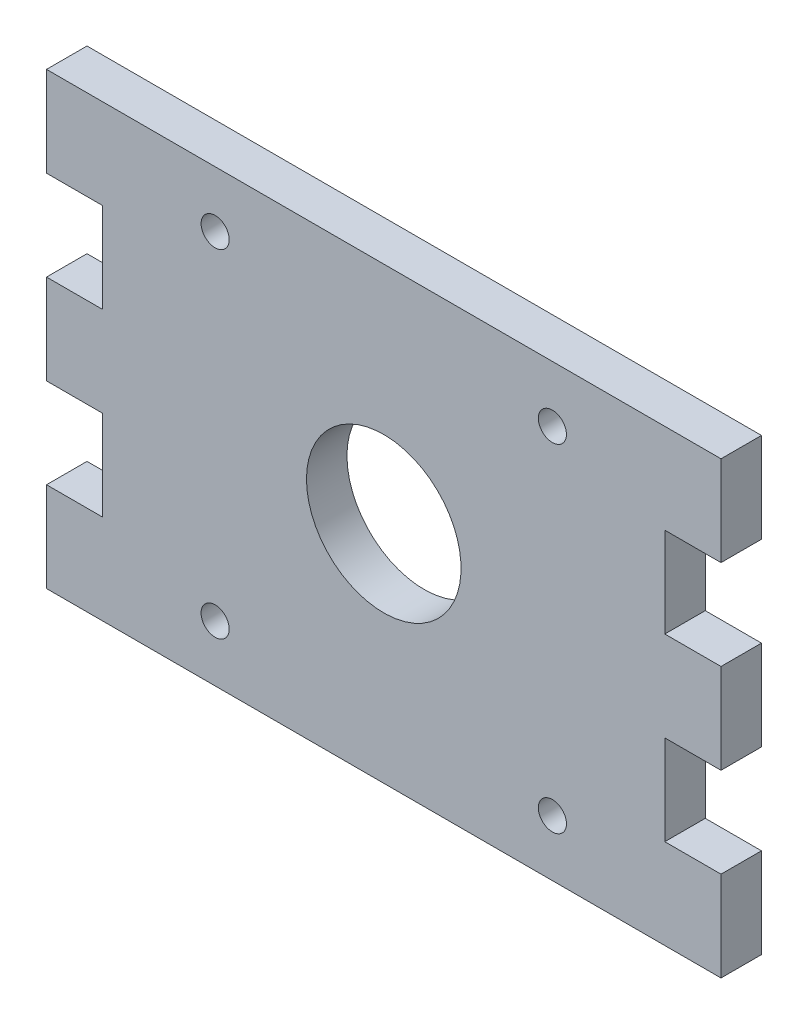
ISO-10303-21;
HEADER;
FILE_DESCRIPTION(('STEP AP214'),'2;1');
FILE_NAME('part.step','',(''),(''),'','','');
FILE_SCHEMA(('AUTOMOTIVE_DESIGN { 1 0 10303 214 1 1 1 1 }'));
ENDSEC;
DATA;
#1=APPLICATION_CONTEXT('core data for automotive mechanical design processes');
#2=APPLICATION_PROTOCOL_DEFINITION('international standard','automotive_design',2000,#1);
#3=PRODUCT_CONTEXT('',#1,'mechanical');
#4=PRODUCT('Part','Part','',(#3));
#5=PRODUCT_RELATED_PRODUCT_CATEGORY('part','',(#4));
#6=PRODUCT_DEFINITION_FORMATION('','',#4);
#7=PRODUCT_DEFINITION_CONTEXT('part definition',#1,'design');
#8=PRODUCT_DEFINITION('design','',#6,#7);
#9=PRODUCT_DEFINITION_SHAPE('','',#8);
#10=(LENGTH_UNIT() NAMED_UNIT(*) SI_UNIT(.MILLI.,.METRE.));
#11=(NAMED_UNIT(*) PLANE_ANGLE_UNIT() SI_UNIT($,.RADIAN.));
#12=(NAMED_UNIT(*) SI_UNIT($,.STERADIAN.) SOLID_ANGLE_UNIT());
#13=UNCERTAINTY_MEASURE_WITH_UNIT(LENGTH_MEASURE(1.E-05),#10,'distance_accuracy_value','');
#14=(GEOMETRIC_REPRESENTATION_CONTEXT(3) GLOBAL_UNCERTAINTY_ASSIGNED_CONTEXT((#13)) GLOBAL_UNIT_ASSIGNED_CONTEXT((#10,
#11,#12)) REPRESENTATION_CONTEXT('',''));
#15=CARTESIAN_POINT('',(0.,0.,0.));
#16=DIRECTION('',(0.,0.,1.));
#17=DIRECTION('',(1.,0.,0.));
#18=AXIS2_PLACEMENT_3D('',#15,#16,#17);
#19=CARTESIAN_POINT('',(0.,50.8,4.572));
#20=DIRECTION('',(0.,0.,-1.));
#21=DIRECTION('',(-1.,0.,0.));
#22=AXIS2_PLACEMENT_3D('',#19,#20,#21);
#23=PLANE('',#22);
#24=CARTESIAN_POINT('',(57.150000000022,6.34999999999933,4.572));
#25=DIRECTION('',(0.,0.,-1.));
#26=DIRECTION('',(-1.,0.,0.));
#27=AXIS2_PLACEMENT_3D('',#24,#25,#26);
#28=CIRCLE('',#27,1.58750000002028);
#29=CARTESIAN_POINT('',(55.5625000000017,6.34999999999933,4.572));
#30=VERTEX_POINT('',#29);
#31=EDGE_CURVE('E241',#30,#30,#28,.T.);
#32=ORIENTED_EDGE('',*,*,#31,.T.);
#33=EDGE_LOOP('',(#32));
#34=FACE_BOUND('',#33,.T.);
#35=CARTESIAN_POINT('',(57.1500000000189,44.4500000000022,4.572));
#36=DIRECTION('',(0.,0.,-1.));
#37=DIRECTION('',(-1.,0.,0.));
#38=AXIS2_PLACEMENT_3D('',#35,#36,#37);
#39=CIRCLE('',#38,1.58750000001656);
#40=CARTESIAN_POINT('',(55.5625000000024,44.4500000000022,4.572));
#41=VERTEX_POINT('',#40);
#42=EDGE_CURVE('E247',#41,#41,#39,.T.);
#43=ORIENTED_EDGE('',*,*,#42,.T.);
#44=EDGE_LOOP('',(#43));
#45=FACE_BOUND('',#44,.T.);
#46=CARTESIAN_POINT('',(19.0500000000181,6.35000000000216,4.572));
#47=DIRECTION('',(0.,0.,-1.));
#48=DIRECTION('',(-1.,0.,0.));
#49=AXIS2_PLACEMENT_3D('',#46,#47,#48);
#50=CIRCLE('',#49,1.5875000000158);
#51=CARTESIAN_POINT('',(17.4625000000023,6.35000000000216,4.572));
#52=VERTEX_POINT('',#51);
#53=EDGE_CURVE('E253',#52,#52,#50,.T.);
#54=ORIENTED_EDGE('',*,*,#53,.T.);
#55=EDGE_LOOP('',(#54));
#56=FACE_BOUND('',#55,.T.);
#57=CARTESIAN_POINT('',(19.0500000000189,44.4500000000022,4.572));
#58=DIRECTION('',(0.,0.,-1.));
#59=DIRECTION('',(-1.,0.,0.));
#60=AXIS2_PLACEMENT_3D('',#57,#58,#59);
#61=CIRCLE('',#60,1.58750000001656);
#62=CARTESIAN_POINT('',(17.4625000000024,44.4500000000022,4.572));
#63=VERTEX_POINT('',#62);
#64=EDGE_CURVE('E259',#63,#63,#61,.T.);
#65=ORIENTED_EDGE('',*,*,#64,.T.);
#66=EDGE_LOOP('',(#65));
#67=FACE_BOUND('',#66,.T.);
#68=CARTESIAN_POINT('',(38.1,25.4,4.572));
#69=DIRECTION('',(0.,0.,-1.));
#70=DIRECTION('',(-1.,0.,0.));
#71=AXIS2_PLACEMENT_3D('',#68,#69,#70);
#72=CIRCLE('',#71,8.73125);
#73=CARTESIAN_POINT('',(29.36875,25.4,4.572));
#74=VERTEX_POINT('',#73);
#75=EDGE_CURVE('E265',#74,#74,#72,.T.);
#76=ORIENTED_EDGE('',*,*,#75,.T.);
#77=EDGE_LOOP('',(#76));
#78=FACE_BOUND('',#77,.T.);
#79=DIRECTION('',(1.,0.,0.));
#80=VECTOR('',#79,1.);
#81=CARTESIAN_POINT('',(69.85,10.16,4.57200000000001));
#82=LINE('',#81,#80);
#83=CARTESIAN_POINT('',(69.85,10.16,4.57200000000001));
#84=VERTEX_POINT('',#83);
#85=CARTESIAN_POINT('',(76.2,10.16,4.57200000000001));
#86=VERTEX_POINT('',#85);
#87=EDGE_CURVE('E195',#84,#86,#82,.T.);
#88=ORIENTED_EDGE('',*,*,#87,.F.);
#89=DIRECTION('',(0.,-1.,0.));
#90=VECTOR('',#89,1.);
#91=CARTESIAN_POINT('',(69.8500000000001,50.8,4.57200000000001));
#92=LINE('',#91,#90);
#93=CARTESIAN_POINT('',(69.85,20.32,4.57200000000001));
#94=VERTEX_POINT('',#93);
#95=EDGE_CURVE('E190',#94,#84,#92,.T.);
#96=ORIENTED_EDGE('',*,*,#95,.F.);
#97=DIRECTION('',(1.,0.,0.));
#98=VECTOR('',#97,1.);
#99=CARTESIAN_POINT('',(69.85,20.32,4.57200000000001));
#100=LINE('',#99,#98);
#101=CARTESIAN_POINT('',(76.2,20.32,4.57200000000001));
#102=VERTEX_POINT('',#101);
#103=EDGE_CURVE('E370',#94,#102,#100,.T.);
#104=ORIENTED_EDGE('',*,*,#103,.T.);
#105=DIRECTION('',(0.,1.,0.));
#106=VECTOR('',#105,1.);
#107=CARTESIAN_POINT('',(76.2,0.,4.572));
#108=LINE('',#107,#106);
#109=CARTESIAN_POINT('',(76.2,30.48,4.57200000000001));
#110=VERTEX_POINT('',#109);
#111=EDGE_CURVE('E283',#102,#110,#108,.T.);
#112=ORIENTED_EDGE('',*,*,#111,.T.);
#113=DIRECTION('',(1.,0.,0.));
#114=VECTOR('',#113,1.);
#115=CARTESIAN_POINT('',(69.85,30.48,4.57200000000001));
#116=LINE('',#115,#114);
#117=CARTESIAN_POINT('',(69.85,30.48,4.57200000000001));
#118=VERTEX_POINT('',#117);
#119=EDGE_CURVE('E188',#118,#110,#116,.T.);
#120=ORIENTED_EDGE('',*,*,#119,.F.);
#121=CARTESIAN_POINT('',(69.8500000000001,40.64,4.57200000000001));
#122=VERTEX_POINT('',#121);
#123=EDGE_CURVE('E171',#122,#118,#92,.T.);
#124=ORIENTED_EDGE('',*,*,#123,.F.);
#125=DIRECTION('',(1.,0.,0.));
#126=VECTOR('',#125,1.);
#127=CARTESIAN_POINT('',(69.8500000000001,40.64,4.57200000000001));
#128=LINE('',#127,#126);
#129=CARTESIAN_POINT('',(76.2,40.64,4.57200000000001));
#130=VERTEX_POINT('',#129);
#131=EDGE_CURVE('E175',#122,#130,#128,.T.);
#132=ORIENTED_EDGE('',*,*,#131,.T.);
#133=CARTESIAN_POINT('',(76.2,50.8,4.572));
#134=VERTEX_POINT('',#133);
#135=EDGE_CURVE('E278',#130,#134,#108,.T.);
#136=ORIENTED_EDGE('',*,*,#135,.T.);
#137=DIRECTION('',(-1.,0.,0.));
#138=VECTOR('',#137,1.);
#139=CARTESIAN_POINT('',(0.,50.8,4.572));
#140=LINE('',#139,#138);
#141=CARTESIAN_POINT('',(0.,50.8,4.572));
#142=VERTEX_POINT('',#141);
#143=EDGE_CURVE('E282',#134,#142,#140,.T.);
#144=ORIENTED_EDGE('',*,*,#143,.T.);
#145=DIRECTION('',(0.,-1.,0.));
#146=VECTOR('',#145,1.);
#147=CARTESIAN_POINT('',(0.,0.,4.572));
#148=LINE('',#147,#146);
#149=CARTESIAN_POINT('',(0.,40.64,4.57199999999998));
#150=VERTEX_POINT('',#149);
#151=EDGE_CURVE('E271',#142,#150,#148,.T.);
#152=ORIENTED_EDGE('',*,*,#151,.T.);
#153=DIRECTION('',(1.,0.,0.));
#154=VECTOR('',#153,1.);
#155=CARTESIAN_POINT('',(0.,40.64,4.57199999999998));
#156=LINE('',#155,#154);
#157=CARTESIAN_POINT('',(6.35,40.64,4.57199999999998));
#158=VERTEX_POINT('',#157);
#159=EDGE_CURVE('E200',#150,#158,#156,.T.);
#160=ORIENTED_EDGE('',*,*,#159,.T.);
#161=DIRECTION('',(0.,-1.,0.));
#162=VECTOR('',#161,1.);
#163=CARTESIAN_POINT('',(6.35,50.8,4.57199999999998));
#164=LINE('',#163,#162);
#165=CARTESIAN_POINT('',(6.34999999999999,30.48,4.57199999999998));
#166=VERTEX_POINT('',#165);
#167=EDGE_CURVE('E237',#158,#166,#164,.T.);
#168=ORIENTED_EDGE('',*,*,#167,.T.);
#169=DIRECTION('',(1.,0.,0.));
#170=VECTOR('',#169,1.);
#171=CARTESIAN_POINT('',(0.,30.48,4.57199999999998));
#172=LINE('',#171,#170);
#173=CARTESIAN_POINT('',(0.,30.48,4.57199999999998));
#174=VERTEX_POINT('',#173);
#175=EDGE_CURVE('E216',#174,#166,#172,.T.);
#176=ORIENTED_EDGE('',*,*,#175,.F.);
#177=CARTESIAN_POINT('',(0.,20.32,4.57199999999998));
#178=VERTEX_POINT('',#177);
#179=EDGE_CURVE('E275',#174,#178,#148,.T.);
#180=ORIENTED_EDGE('',*,*,#179,.T.);
#181=DIRECTION('',(1.,0.,0.));
#182=VECTOR('',#181,1.);
#183=CARTESIAN_POINT('',(0.,20.32,4.57199999999998));
#184=LINE('',#183,#182);
#185=CARTESIAN_POINT('',(6.34999999999999,20.32,4.57199999999998));
#186=VERTEX_POINT('',#185);
#187=EDGE_CURVE('E212',#178,#186,#184,.T.);
#188=ORIENTED_EDGE('',*,*,#187,.T.);
#189=CARTESIAN_POINT('',(6.34999999999999,10.16,4.57199999999998));
#190=VERTEX_POINT('',#189);
#191=EDGE_CURVE('E234',#186,#190,#164,.T.);
#192=ORIENTED_EDGE('',*,*,#191,.T.);
#193=DIRECTION('',(1.,0.,0.));
#194=VECTOR('',#193,1.);
#195=CARTESIAN_POINT('',(0.,10.16,4.57199999999998));
#196=LINE('',#195,#194);
#197=CARTESIAN_POINT('',(0.,10.16,4.57199999999998));
#198=VERTEX_POINT('',#197);
#199=EDGE_CURVE('E231',#198,#190,#196,.T.);
#200=ORIENTED_EDGE('',*,*,#199,.F.);
#201=CARTESIAN_POINT('',(0.,0.,4.572));
#202=VERTEX_POINT('',#201);
#203=EDGE_CURVE('E276',#198,#202,#148,.T.);
#204=ORIENTED_EDGE('',*,*,#203,.T.);
#205=DIRECTION('',(1.,0.,0.));
#206=VECTOR('',#205,1.);
#207=CARTESIAN_POINT('',(0.,0.,4.572));
#208=LINE('',#207,#206);
#209=CARTESIAN_POINT('',(76.2,0.,4.572));
#210=VERTEX_POINT('',#209);
#211=EDGE_CURVE('E274',#202,#210,#208,.T.);
#212=ORIENTED_EDGE('',*,*,#211,.T.);
#213=EDGE_CURVE('E279',#210,#86,#108,.T.);
#214=ORIENTED_EDGE('',*,*,#213,.T.);
#215=EDGE_LOOP('',(#88,#96,#104,#112,#120,#124,#132,#136,#144,#152,#160,#168,#176,#180,#188,
#192,#200,#204,#212,#214));
#216=FACE_BOUND('',#215,.T.);
#217=ADVANCED_FACE('F34',(#34,#45,#56,#67,#78,#216),#23,.F.);
#218=CARTESIAN_POINT('',(76.2,0.,4.572));
#219=DIRECTION('',(-1.,0.,0.));
#220=DIRECTION('',(0.,-1.,0.));
#221=AXIS2_PLACEMENT_3D('',#218,#219,#220);
#222=PLANE('',#221);
#223=DIRECTION('',(0.,0.,1.));
#224=VECTOR('',#223,1.);
#225=CARTESIAN_POINT('',(76.2,10.16,4.57200000000001));
#226=LINE('',#225,#224);
#227=CARTESIAN_POINT('',(76.2,10.16,0.));
#228=VERTEX_POINT('',#227);
#229=EDGE_CURVE('E355',#228,#86,#226,.T.);
#230=ORIENTED_EDGE('',*,*,#229,.T.);
#231=ORIENTED_EDGE('',*,*,#213,.F.);
#232=DIRECTION('',(0.,0.,-1.));
#233=VECTOR('',#232,1.);
#234=CARTESIAN_POINT('',(76.2,0.,4.572));
#235=LINE('',#234,#233);
#236=CARTESIAN_POINT('',(76.2,0.,0.));
#237=VERTEX_POINT('',#236);
#238=EDGE_CURVE('E304',#210,#237,#235,.T.);
#239=ORIENTED_EDGE('',*,*,#238,.T.);
#240=DIRECTION('',(0.,1.,0.));
#241=VECTOR('',#240,1.);
#242=CARTESIAN_POINT('',(76.2,0.,0.));
#243=LINE('',#242,#241);
#244=EDGE_CURVE('E293',#237,#228,#243,.T.);
#245=ORIENTED_EDGE('',*,*,#244,.T.);
#246=EDGE_LOOP('',(#230,#231,#239,#245));
#247=FACE_BOUND('',#246,.T.);
#248=ADVANCED_FACE('F354',(#247),#222,.F.);
#249=DIRECTION('',(0.,0.,1.));
#250=VECTOR('',#249,1.);
#251=CARTESIAN_POINT('',(76.2,30.48,4.57200000000001));
#252=LINE('',#251,#250);
#253=CARTESIAN_POINT('',(76.2,30.48,0.));
#254=VERTEX_POINT('',#253);
#255=EDGE_CURVE('E381',#254,#110,#252,.T.);
#256=ORIENTED_EDGE('',*,*,#255,.T.);
#257=ORIENTED_EDGE('',*,*,#111,.F.);
#258=DIRECTION('',(0.,0.,-1.));
#259=VECTOR('',#258,1.);
#260=CARTESIAN_POINT('',(76.2,20.32,4.57200000000001));
#261=LINE('',#260,#259);
#262=CARTESIAN_POINT('',(76.2,20.32,0.));
#263=VERTEX_POINT('',#262);
#264=EDGE_CURVE('E379',#102,#263,#261,.T.);
#265=ORIENTED_EDGE('',*,*,#264,.T.);
#266=EDGE_CURVE('E297',#263,#254,#243,.T.);
#267=ORIENTED_EDGE('',*,*,#266,.T.);
#268=EDGE_LOOP('',(#256,#257,#265,#267));
#269=FACE_BOUND('',#268,.T.);
#270=ADVANCED_FACE('F377',(#269),#222,.F.);
#271=DIRECTION('',(0.,0.,-1.));
#272=VECTOR('',#271,1.);
#273=CARTESIAN_POINT('',(76.2,40.64,4.57200000000001));
#274=LINE('',#273,#272);
#275=CARTESIAN_POINT('',(76.2,40.64,0.));
#276=VERTEX_POINT('',#275);
#277=EDGE_CURVE('E176',#130,#276,#274,.T.);
#278=ORIENTED_EDGE('',*,*,#277,.T.);
#279=CARTESIAN_POINT('',(76.2,50.8,0.));
#280=VERTEX_POINT('',#279);
#281=EDGE_CURVE('E292',#276,#280,#243,.T.);
#282=ORIENTED_EDGE('',*,*,#281,.T.);
#283=DIRECTION('',(0.,0.,-1.));
#284=VECTOR('',#283,1.);
#285=CARTESIAN_POINT('',(76.2,50.8,4.572));
#286=LINE('',#285,#284);
#287=EDGE_CURVE('E301',#134,#280,#286,.T.);
#288=ORIENTED_EDGE('',*,*,#287,.F.);
#289=ORIENTED_EDGE('',*,*,#135,.F.);
#290=EDGE_LOOP('',(#278,#282,#288,#289));
#291=FACE_BOUND('',#290,.T.);
#292=ADVANCED_FACE('F386',(#291),#222,.F.);
#293=CARTESIAN_POINT('',(0.,0.,4.572));
#294=DIRECTION('',(1.,0.,0.));
#295=DIRECTION('',(0.,1.,0.));
#296=AXIS2_PLACEMENT_3D('',#293,#294,#295);
#297=PLANE('',#296);
#298=DIRECTION('',(0.,0.,1.));
#299=VECTOR('',#298,1.);
#300=CARTESIAN_POINT('',(0.,10.16,4.57199999999998));
#301=LINE('',#300,#299);
#302=CARTESIAN_POINT('',(0.,10.16,0.));
#303=VERTEX_POINT('',#302);
#304=EDGE_CURVE('E227',#303,#198,#301,.T.);
#305=ORIENTED_EDGE('',*,*,#304,.F.);
#306=DIRECTION('',(0.,-1.,0.));
#307=VECTOR('',#306,1.);
#308=CARTESIAN_POINT('',(0.,0.,0.));
#309=LINE('',#308,#307);
#310=CARTESIAN_POINT('',(0.,0.,0.));
#311=VERTEX_POINT('',#310);
#312=EDGE_CURVE('E268',#303,#311,#309,.T.);
#313=ORIENTED_EDGE('',*,*,#312,.T.);
#314=DIRECTION('',(0.,0.,-1.));
#315=VECTOR('',#314,1.);
#316=CARTESIAN_POINT('',(0.,0.,4.572));
#317=LINE('',#316,#315);
#318=EDGE_CURVE('E307',#202,#311,#317,.T.);
#319=ORIENTED_EDGE('',*,*,#318,.F.);
#320=ORIENTED_EDGE('',*,*,#203,.F.);
#321=EDGE_LOOP('',(#305,#313,#319,#320));
#322=FACE_BOUND('',#321,.T.);
#323=ADVANCED_FACE('F36',(#322),#297,.F.);
#324=DIRECTION('',(0.,0.,1.));
#325=VECTOR('',#324,1.);
#326=CARTESIAN_POINT('',(0.,30.48,4.57199999999998));
#327=LINE('',#326,#325);
#328=CARTESIAN_POINT('',(0.,30.48,0.));
#329=VERTEX_POINT('',#328);
#330=EDGE_CURVE('E209',#329,#174,#327,.T.);
#331=ORIENTED_EDGE('',*,*,#330,.F.);
#332=CARTESIAN_POINT('',(0.,20.32,0.));
#333=VERTEX_POINT('',#332);
#334=EDGE_CURVE('E290',#329,#333,#309,.T.);
#335=ORIENTED_EDGE('',*,*,#334,.T.);
#336=DIRECTION('',(0.,0.,-1.));
#337=VECTOR('',#336,1.);
#338=CARTESIAN_POINT('',(0.,20.32,4.57199999999998));
#339=LINE('',#338,#337);
#340=EDGE_CURVE('E207',#178,#333,#339,.T.);
#341=ORIENTED_EDGE('',*,*,#340,.F.);
#342=ORIENTED_EDGE('',*,*,#179,.F.);
#343=EDGE_LOOP('',(#331,#335,#341,#342));
#344=FACE_BOUND('',#343,.T.);
#345=ADVANCED_FACE('F340',(#344),#297,.F.);
#346=DIRECTION('',(0.,0.,-1.));
#347=VECTOR('',#346,1.);
#348=CARTESIAN_POINT('',(0.,40.64,4.57199999999998));
#349=LINE('',#348,#347);
#350=CARTESIAN_POINT('',(0.,40.64,0.));
#351=VERTEX_POINT('',#350);
#352=EDGE_CURVE('E193',#150,#351,#349,.T.);
#353=ORIENTED_EDGE('',*,*,#352,.F.);
#354=ORIENTED_EDGE('',*,*,#151,.F.);
#355=DIRECTION('',(0.,0.,-1.));
#356=VECTOR('',#355,1.);
#357=CARTESIAN_POINT('',(0.,50.8,4.572));
#358=LINE('',#357,#356);
#359=CARTESIAN_POINT('',(0.,50.8,0.));
#360=VERTEX_POINT('',#359);
#361=EDGE_CURVE('E285',#142,#360,#358,.T.);
#362=ORIENTED_EDGE('',*,*,#361,.T.);
#363=EDGE_CURVE('E286',#360,#351,#309,.T.);
#364=ORIENTED_EDGE('',*,*,#363,.T.);
#365=EDGE_LOOP('',(#353,#354,#362,#364));
#366=FACE_BOUND('',#365,.T.);
#367=ADVANCED_FACE('F395',(#366),#297,.F.);
#368=CARTESIAN_POINT('',(0.,0.,4.572));
#369=DIRECTION('',(0.,1.,0.));
#370=DIRECTION('',(0.,0.,1.));
#371=AXIS2_PLACEMENT_3D('',#368,#369,#370);
#372=PLANE('',#371);
#373=DIRECTION('',(1.,0.,0.));
#374=VECTOR('',#373,1.);
#375=CARTESIAN_POINT('',(0.,0.,0.));
#376=LINE('',#375,#374);
#377=EDGE_CURVE('E289',#311,#237,#376,.T.);
#378=ORIENTED_EDGE('',*,*,#377,.T.);
#379=ORIENTED_EDGE('',*,*,#238,.F.);
#380=ORIENTED_EDGE('',*,*,#211,.F.);
#381=ORIENTED_EDGE('',*,*,#318,.T.);
#382=EDGE_LOOP('',(#378,#379,#380,#381));
#383=FACE_BOUND('',#382,.T.);
#384=ADVANCED_FACE('F349',(#383),#372,.F.);
#385=CARTESIAN_POINT('',(0.,50.8,4.572));
#386=DIRECTION('',(0.,-1.,0.));
#387=DIRECTION('',(0.,0.,-1.));
#388=AXIS2_PLACEMENT_3D('',#385,#386,#387);
#389=PLANE('',#388);
#390=DIRECTION('',(-1.,0.,0.));
#391=VECTOR('',#390,1.);
#392=CARTESIAN_POINT('',(0.,50.8,0.));
#393=LINE('',#392,#391);
#394=EDGE_CURVE('E296',#280,#360,#393,.T.);
#395=ORIENTED_EDGE('',*,*,#394,.T.);
#396=ORIENTED_EDGE('',*,*,#361,.F.);
#397=ORIENTED_EDGE('',*,*,#143,.F.);
#398=ORIENTED_EDGE('',*,*,#287,.T.);
#399=EDGE_LOOP('',(#395,#396,#397,#398));
#400=FACE_BOUND('',#399,.T.);
#401=ADVANCED_FACE('F390',(#400),#389,.F.);
#402=CARTESIAN_POINT('',(0.,50.8,0.));
#403=DIRECTION('',(0.,0.,-1.));
#404=DIRECTION('',(-1.,0.,0.));
#405=AXIS2_PLACEMENT_3D('',#402,#403,#404);
#406=PLANE('',#405);
#407=DIRECTION('',(0.,1.,0.));
#408=VECTOR('',#407,1.);
#409=CARTESIAN_POINT('',(69.8500000000001,50.8,0.));
#410=LINE('',#409,#408);
#411=CARTESIAN_POINT('',(69.85,10.16,0.));
#412=VERTEX_POINT('',#411);
#413=CARTESIAN_POINT('',(69.85,20.32,0.));
#414=VERTEX_POINT('',#413);
#415=EDGE_CURVE('E42',#412,#414,#410,.T.);
#416=ORIENTED_EDGE('',*,*,#415,.F.);
#417=DIRECTION('',(1.,0.,0.));
#418=VECTOR('',#417,1.);
#419=CARTESIAN_POINT('',(69.85,10.16,0.));
#420=LINE('',#419,#418);
#421=EDGE_CURVE('E198',#412,#228,#420,.T.);
#422=ORIENTED_EDGE('',*,*,#421,.T.);
#423=ORIENTED_EDGE('',*,*,#244,.F.);
#424=ORIENTED_EDGE('',*,*,#377,.F.);
#425=ORIENTED_EDGE('',*,*,#312,.F.);
#426=DIRECTION('',(1.,0.,0.));
#427=VECTOR('',#426,1.);
#428=CARTESIAN_POINT('',(0.,10.16,0.));
#429=LINE('',#428,#427);
#430=CARTESIAN_POINT('',(6.34999999999999,10.16,0.));
#431=VERTEX_POINT('',#430);
#432=EDGE_CURVE('E229',#303,#431,#429,.T.);
#433=ORIENTED_EDGE('',*,*,#432,.T.);
#434=DIRECTION('',(0.,1.,0.));
#435=VECTOR('',#434,1.);
#436=CARTESIAN_POINT('',(6.35,50.8,0.));
#437=LINE('',#436,#435);
#438=CARTESIAN_POINT('',(6.34999999999999,20.32,0.));
#439=VERTEX_POINT('',#438);
#440=EDGE_CURVE('E309',#431,#439,#437,.T.);
#441=ORIENTED_EDGE('',*,*,#440,.T.);
#442=DIRECTION('',(1.,0.,0.));
#443=VECTOR('',#442,1.);
#444=CARTESIAN_POINT('',(0.,20.32,0.));
#445=LINE('',#444,#443);
#446=EDGE_CURVE('E223',#333,#439,#445,.T.);
#447=ORIENTED_EDGE('',*,*,#446,.F.);
#448=ORIENTED_EDGE('',*,*,#334,.F.);
#449=DIRECTION('',(1.,0.,0.));
#450=VECTOR('',#449,1.);
#451=CARTESIAN_POINT('',(0.,30.48,0.));
#452=LINE('',#451,#450);
#453=CARTESIAN_POINT('',(6.34999999999999,30.48,0.));
#454=VERTEX_POINT('',#453);
#455=EDGE_CURVE('E220',#329,#454,#452,.T.);
#456=ORIENTED_EDGE('',*,*,#455,.T.);
#457=CARTESIAN_POINT('',(6.35,40.64,0.));
#458=VERTEX_POINT('',#457);
#459=EDGE_CURVE('E310',#454,#458,#437,.T.);
#460=ORIENTED_EDGE('',*,*,#459,.T.);
#461=DIRECTION('',(1.,0.,0.));
#462=VECTOR('',#461,1.);
#463=CARTESIAN_POINT('',(0.,40.64,0.));
#464=LINE('',#463,#462);
#465=EDGE_CURVE('E202',#351,#458,#464,.T.);
#466=ORIENTED_EDGE('',*,*,#465,.F.);
#467=ORIENTED_EDGE('',*,*,#363,.F.);
#468=ORIENTED_EDGE('',*,*,#394,.F.);
#469=ORIENTED_EDGE('',*,*,#281,.F.);
#470=DIRECTION('',(1.,0.,0.));
#471=VECTOR('',#470,1.);
#472=CARTESIAN_POINT('',(69.8500000000001,40.64,0.));
#473=LINE('',#472,#471);
#474=CARTESIAN_POINT('',(69.8500000000001,40.64,0.));
#475=VERTEX_POINT('',#474);
#476=EDGE_CURVE('E183',#475,#276,#473,.T.);
#477=ORIENTED_EDGE('',*,*,#476,.F.);
#478=CARTESIAN_POINT('',(69.85,30.48,0.));
#479=VERTEX_POINT('',#478);
#480=EDGE_CURVE('E11',#479,#475,#410,.T.);
#481=ORIENTED_EDGE('',*,*,#480,.F.);
#482=DIRECTION('',(1.,0.,0.));
#483=VECTOR('',#482,1.);
#484=CARTESIAN_POINT('',(69.85,30.48,0.));
#485=LINE('',#484,#483);
#486=EDGE_CURVE('E362',#479,#254,#485,.T.);
#487=ORIENTED_EDGE('',*,*,#486,.T.);
#488=ORIENTED_EDGE('',*,*,#266,.F.);
#489=DIRECTION('',(1.,0.,0.));
#490=VECTOR('',#489,1.);
#491=CARTESIAN_POINT('',(69.85,20.32,0.));
#492=LINE('',#491,#490);
#493=EDGE_CURVE('E372',#414,#263,#492,.T.);
#494=ORIENTED_EDGE('',*,*,#493,.F.);
#495=EDGE_LOOP('',(#416,#422,#423,#424,#425,#433,#441,#447,#448,#456,#460,#466,#467,#468,#469,
#477,#481,#487,#488,#494));
#496=FACE_BOUND('',#495,.T.);
#497=CARTESIAN_POINT('',(57.150000000022,6.34999999999933,0.));
#498=DIRECTION('',(0.,0.,-1.));
#499=DIRECTION('',(-1.,0.,0.));
#500=AXIS2_PLACEMENT_3D('',#497,#498,#499);
#501=CIRCLE('',#500,1.58750000002028);
#502=CARTESIAN_POINT('',(55.5625000000017,6.34999999999933,0.));
#503=VERTEX_POINT('',#502);
#504=EDGE_CURVE('E240',#503,#503,#501,.T.);
#505=ORIENTED_EDGE('',*,*,#504,.F.);
#506=EDGE_LOOP('',(#505));
#507=FACE_BOUND('',#506,.T.);
#508=CARTESIAN_POINT('',(57.1500000000189,44.4500000000022,0.));
#509=DIRECTION('',(0.,0.,-1.));
#510=DIRECTION('',(-1.,0.,0.));
#511=AXIS2_PLACEMENT_3D('',#508,#509,#510);
#512=CIRCLE('',#511,1.58750000001656);
#513=CARTESIAN_POINT('',(55.5625000000024,44.4500000000022,0.));
#514=VERTEX_POINT('',#513);
#515=EDGE_CURVE('E244',#514,#514,#512,.T.);
#516=ORIENTED_EDGE('',*,*,#515,.F.);
#517=EDGE_LOOP('',(#516));
#518=FACE_BOUND('',#517,.T.);
#519=CARTESIAN_POINT('',(19.0500000000181,6.35000000000216,0.));
#520=DIRECTION('',(0.,0.,-1.));
#521=DIRECTION('',(-1.,0.,0.));
#522=AXIS2_PLACEMENT_3D('',#519,#520,#521);
#523=CIRCLE('',#522,1.5875000000158);
#524=CARTESIAN_POINT('',(17.4625000000023,6.35000000000216,0.));
#525=VERTEX_POINT('',#524);
#526=EDGE_CURVE('E250',#525,#525,#523,.T.);
#527=ORIENTED_EDGE('',*,*,#526,.F.);
#528=EDGE_LOOP('',(#527));
#529=FACE_BOUND('',#528,.T.);
#530=CARTESIAN_POINT('',(19.0500000000189,44.4500000000022,0.));
#531=DIRECTION('',(0.,0.,-1.));
#532=DIRECTION('',(-1.,0.,0.));
#533=AXIS2_PLACEMENT_3D('',#530,#531,#532);
#534=CIRCLE('',#533,1.58750000001656);
#535=CARTESIAN_POINT('',(17.4625000000024,44.4500000000022,0.));
#536=VERTEX_POINT('',#535);
#537=EDGE_CURVE('E256',#536,#536,#534,.T.);
#538=ORIENTED_EDGE('',*,*,#537,.F.);
#539=EDGE_LOOP('',(#538));
#540=FACE_BOUND('',#539,.T.);
#541=CARTESIAN_POINT('',(38.1,25.4,0.));
#542=DIRECTION('',(0.,0.,-1.));
#543=DIRECTION('',(-1.,0.,0.));
#544=AXIS2_PLACEMENT_3D('',#541,#542,#543);
#545=CIRCLE('',#544,8.73125);
#546=CARTESIAN_POINT('',(29.36875,25.4,0.));
#547=VERTEX_POINT('',#546);
#548=EDGE_CURVE('E262',#547,#547,#545,.T.);
#549=ORIENTED_EDGE('',*,*,#548,.F.);
#550=EDGE_LOOP('',(#549));
#551=FACE_BOUND('',#550,.T.);
#552=ADVANCED_FACE('F317',(#496,#507,#518,#529,#540,#551),#406,.T.);
#553=CARTESIAN_POINT('',(38.1,25.4,4.572));
#554=DIRECTION('',(0.,0.,-1.));
#555=DIRECTION('',(-1.,0.,0.));
#556=AXIS2_PLACEMENT_3D('',#553,#554,#555);
#557=CYLINDRICAL_SURFACE('',#556,8.73125);
#558=ORIENTED_EDGE('',*,*,#75,.F.);
#559=EDGE_LOOP('',(#558));
#560=FACE_BOUND('',#559,.T.);
#561=ORIENTED_EDGE('',*,*,#548,.T.);
#562=EDGE_LOOP('',(#561));
#563=FACE_BOUND('',#562,.T.);
#564=ADVANCED_FACE('F424',(#560,#563),#557,.F.);
#565=CARTESIAN_POINT('',(19.0500000000189,44.4500000000022,4.572));
#566=DIRECTION('',(0.,0.,-1.));
#567=DIRECTION('',(-1.,0.,0.));
#568=AXIS2_PLACEMENT_3D('',#565,#566,#567);
#569=CYLINDRICAL_SURFACE('',#568,1.58750000001656);
#570=ORIENTED_EDGE('',*,*,#64,.F.);
#571=EDGE_LOOP('',(#570));
#572=FACE_BOUND('',#571,.T.);
#573=ORIENTED_EDGE('',*,*,#537,.T.);
#574=EDGE_LOOP('',(#573));
#575=FACE_BOUND('',#574,.T.);
#576=ADVANCED_FACE('F484',(#572,#575),#569,.F.);
#577=CARTESIAN_POINT('',(19.0500000000181,6.35000000000216,4.572));
#578=DIRECTION('',(0.,0.,-1.));
#579=DIRECTION('',(-1.,0.,0.));
#580=AXIS2_PLACEMENT_3D('',#577,#578,#579);
#581=CYLINDRICAL_SURFACE('',#580,1.5875000000158);
#582=ORIENTED_EDGE('',*,*,#53,.F.);
#583=EDGE_LOOP('',(#582));
#584=FACE_BOUND('',#583,.T.);
#585=ORIENTED_EDGE('',*,*,#526,.T.);
#586=EDGE_LOOP('',(#585));
#587=FACE_BOUND('',#586,.T.);
#588=ADVANCED_FACE('F474',(#584,#587),#581,.F.);
#589=CARTESIAN_POINT('',(57.1500000000189,44.4500000000022,4.572));
#590=DIRECTION('',(0.,0.,-1.));
#591=DIRECTION('',(-1.,0.,0.));
#592=AXIS2_PLACEMENT_3D('',#589,#590,#591);
#593=CYLINDRICAL_SURFACE('',#592,1.58750000001656);
#594=ORIENTED_EDGE('',*,*,#42,.F.);
#595=EDGE_LOOP('',(#594));
#596=FACE_BOUND('',#595,.T.);
#597=ORIENTED_EDGE('',*,*,#515,.T.);
#598=EDGE_LOOP('',(#597));
#599=FACE_BOUND('',#598,.T.);
#600=ADVANCED_FACE('F463',(#596,#599),#593,.F.);
#601=CARTESIAN_POINT('',(57.150000000022,6.34999999999933,4.572));
#602=DIRECTION('',(0.,0.,-1.));
#603=DIRECTION('',(-1.,0.,0.));
#604=AXIS2_PLACEMENT_3D('',#601,#602,#603);
#605=CYLINDRICAL_SURFACE('',#604,1.58750000002028);
#606=ORIENTED_EDGE('',*,*,#31,.F.);
#607=EDGE_LOOP('',(#606));
#608=FACE_BOUND('',#607,.T.);
#609=ORIENTED_EDGE('',*,*,#504,.T.);
#610=EDGE_LOOP('',(#609));
#611=FACE_BOUND('',#610,.T.);
#612=ADVANCED_FACE('F411',(#608,#611),#605,.F.);
#613=CARTESIAN_POINT('',(0.,40.64,4.57199999999998));
#614=DIRECTION('',(0.,-1.,0.));
#615=DIRECTION('',(1.,0.,0.));
#616=AXIS2_PLACEMENT_3D('',#613,#614,#615);
#617=PLANE('',#616);
#618=DIRECTION('',(0.,0.,-1.));
#619=VECTOR('',#618,1.);
#620=CARTESIAN_POINT('',(6.35,40.64,4.57199999999998));
#621=LINE('',#620,#619);
#622=EDGE_CURVE('E189',#158,#458,#621,.T.);
#623=ORIENTED_EDGE('',*,*,#622,.F.);
#624=ORIENTED_EDGE('',*,*,#159,.F.);
#625=ORIENTED_EDGE('',*,*,#352,.T.);
#626=ORIENTED_EDGE('',*,*,#465,.T.);
#627=EDGE_LOOP('',(#623,#624,#625,#626));
#628=FACE_BOUND('',#627,.T.);
#629=ADVANCED_FACE('F398',(#628),#617,.T.);
#630=CARTESIAN_POINT('',(0.,30.48,4.57199999999998));
#631=DIRECTION('',(0.,1.,0.));
#632=DIRECTION('',(-1.,0.,0.));
#633=AXIS2_PLACEMENT_3D('',#630,#631,#632);
#634=PLANE('',#633);
#635=DIRECTION('',(0.,0.,1.));
#636=VECTOR('',#635,1.);
#637=CARTESIAN_POINT('',(6.34999999999999,30.48,4.57199999999998));
#638=LINE('',#637,#636);
#639=EDGE_CURVE('E210',#454,#166,#638,.T.);
#640=ORIENTED_EDGE('',*,*,#639,.F.);
#641=ORIENTED_EDGE('',*,*,#455,.F.);
#642=ORIENTED_EDGE('',*,*,#330,.T.);
#643=ORIENTED_EDGE('',*,*,#175,.T.);
#644=EDGE_LOOP('',(#640,#641,#642,#643));
#645=FACE_BOUND('',#644,.T.);
#646=ADVANCED_FACE('F403',(#645),#634,.T.);
#647=CARTESIAN_POINT('',(6.35,50.8,-14.478));
#648=DIRECTION('',(-1.,0.,0.));
#649=DIRECTION('',(0.,0.,-1.));
#650=AXIS2_PLACEMENT_3D('',#647,#648,#649);
#651=PLANE('',#650);
#652=ORIENTED_EDGE('',*,*,#639,.T.);
#653=ORIENTED_EDGE('',*,*,#167,.F.);
#654=ORIENTED_EDGE('',*,*,#622,.T.);
#655=ORIENTED_EDGE('',*,*,#459,.F.);
#656=EDGE_LOOP('',(#652,#653,#654,#655));
#657=FACE_BOUND('',#656,.T.);
#658=ADVANCED_FACE('F400',(#657),#651,.T.);
#659=DIRECTION('',(0.,0.,1.));
#660=VECTOR('',#659,1.);
#661=CARTESIAN_POINT('',(6.34999999999999,10.16,4.57199999999998));
#662=LINE('',#661,#660);
#663=EDGE_CURVE('E219',#431,#190,#662,.T.);
#664=ORIENTED_EDGE('',*,*,#663,.T.);
#665=ORIENTED_EDGE('',*,*,#191,.F.);
#666=DIRECTION('',(0.,0.,-1.));
#667=VECTOR('',#666,1.);
#668=CARTESIAN_POINT('',(6.34999999999999,20.32,4.57199999999998));
#669=LINE('',#668,#667);
#670=EDGE_CURVE('E204',#186,#439,#669,.T.);
#671=ORIENTED_EDGE('',*,*,#670,.T.);
#672=ORIENTED_EDGE('',*,*,#440,.F.);
#673=EDGE_LOOP('',(#664,#665,#671,#672));
#674=FACE_BOUND('',#673,.T.);
#675=ADVANCED_FACE('F324',(#674),#651,.T.);
#676=CARTESIAN_POINT('',(0.,10.16,4.57199999999998));
#677=DIRECTION('',(0.,1.,0.));
#678=DIRECTION('',(-1.,0.,0.));
#679=AXIS2_PLACEMENT_3D('',#676,#677,#678);
#680=PLANE('',#679);
#681=ORIENTED_EDGE('',*,*,#663,.F.);
#682=ORIENTED_EDGE('',*,*,#432,.F.);
#683=ORIENTED_EDGE('',*,*,#304,.T.);
#684=ORIENTED_EDGE('',*,*,#199,.T.);
#685=EDGE_LOOP('',(#681,#682,#683,#684));
#686=FACE_BOUND('',#685,.T.);
#687=ADVANCED_FACE('F327',(#686),#680,.T.);
#688=CARTESIAN_POINT('',(0.,20.32,4.57199999999998));
#689=DIRECTION('',(0.,-1.,0.));
#690=DIRECTION('',(1.,0.,0.));
#691=AXIS2_PLACEMENT_3D('',#688,#689,#690);
#692=PLANE('',#691);
#693=ORIENTED_EDGE('',*,*,#670,.F.);
#694=ORIENTED_EDGE('',*,*,#187,.F.);
#695=ORIENTED_EDGE('',*,*,#340,.T.);
#696=ORIENTED_EDGE('',*,*,#446,.T.);
#697=EDGE_LOOP('',(#693,#694,#695,#696));
#698=FACE_BOUND('',#697,.T.);
#699=ADVANCED_FACE('F337',(#698),#692,.T.);
#700=CARTESIAN_POINT('',(69.8500000000001,40.64,4.57200000000001));
#701=DIRECTION('',(0.,-1.,0.));
#702=DIRECTION('',(1.,0.,0.));
#703=AXIS2_PLACEMENT_3D('',#700,#701,#702);
#704=PLANE('',#703);
#705=ORIENTED_EDGE('',*,*,#277,.F.);
#706=ORIENTED_EDGE('',*,*,#131,.F.);
#707=DIRECTION('',(0.,0.,-1.));
#708=VECTOR('',#707,1.);
#709=CARTESIAN_POINT('',(69.8500000000001,40.64,4.57200000000001));
#710=LINE('',#709,#708);
#711=EDGE_CURVE('E57',#122,#475,#710,.T.);
#712=ORIENTED_EDGE('',*,*,#711,.T.);
#713=ORIENTED_EDGE('',*,*,#476,.T.);
#714=EDGE_LOOP('',(#705,#706,#712,#713));
#715=FACE_BOUND('',#714,.T.);
#716=ADVANCED_FACE('F179',(#715),#704,.T.);
#717=CARTESIAN_POINT('',(69.85,30.48,4.57200000000001));
#718=DIRECTION('',(0.,1.,0.));
#719=DIRECTION('',(-1.,0.,0.));
#720=AXIS2_PLACEMENT_3D('',#717,#718,#719);
#721=PLANE('',#720);
#722=ORIENTED_EDGE('',*,*,#255,.F.);
#723=ORIENTED_EDGE('',*,*,#486,.F.);
#724=DIRECTION('',(0.,0.,1.));
#725=VECTOR('',#724,1.);
#726=CARTESIAN_POINT('',(69.85,30.48,4.57200000000001));
#727=LINE('',#726,#725);
#728=EDGE_CURVE('E373',#479,#118,#727,.T.);
#729=ORIENTED_EDGE('',*,*,#728,.T.);
#730=ORIENTED_EDGE('',*,*,#119,.T.);
#731=EDGE_LOOP('',(#722,#723,#729,#730));
#732=FACE_BOUND('',#731,.T.);
#733=ADVANCED_FACE('F564',(#732),#721,.T.);
#734=CARTESIAN_POINT('',(69.8500000000001,50.8,-14.478));
#735=DIRECTION('',(-1.,0.,0.));
#736=DIRECTION('',(0.,0.,-1.));
#737=AXIS2_PLACEMENT_3D('',#734,#735,#736);
#738=PLANE('',#737);
#739=ORIENTED_EDGE('',*,*,#480,.T.);
#740=ORIENTED_EDGE('',*,*,#711,.F.);
#741=ORIENTED_EDGE('',*,*,#123,.T.);
#742=ORIENTED_EDGE('',*,*,#728,.F.);
#743=EDGE_LOOP('',(#739,#740,#741,#742));
#744=FACE_BOUND('',#743,.T.);
#745=ADVANCED_FACE('F168',(#744),#738,.F.);
#746=ORIENTED_EDGE('',*,*,#415,.T.);
#747=DIRECTION('',(0.,0.,-1.));
#748=VECTOR('',#747,1.);
#749=CARTESIAN_POINT('',(69.85,20.32,4.57200000000001));
#750=LINE('',#749,#748);
#751=EDGE_CURVE('E49',#94,#414,#750,.T.);
#752=ORIENTED_EDGE('',*,*,#751,.F.);
#753=ORIENTED_EDGE('',*,*,#95,.T.);
#754=DIRECTION('',(0.,0.,1.));
#755=VECTOR('',#754,1.);
#756=CARTESIAN_POINT('',(69.85,10.16,4.57200000000001));
#757=LINE('',#756,#755);
#758=EDGE_CURVE('E358',#412,#84,#757,.T.);
#759=ORIENTED_EDGE('',*,*,#758,.F.);
#760=EDGE_LOOP('',(#746,#752,#753,#759));
#761=FACE_BOUND('',#760,.T.);
#762=ADVANCED_FACE('F368',(#761),#738,.F.);
#763=CARTESIAN_POINT('',(69.85,10.16,4.57200000000001));
#764=DIRECTION('',(0.,1.,0.));
#765=DIRECTION('',(-1.,0.,0.));
#766=AXIS2_PLACEMENT_3D('',#763,#764,#765);
#767=PLANE('',#766);
#768=ORIENTED_EDGE('',*,*,#229,.F.);
#769=ORIENTED_EDGE('',*,*,#421,.F.);
#770=ORIENTED_EDGE('',*,*,#758,.T.);
#771=ORIENTED_EDGE('',*,*,#87,.T.);
#772=EDGE_LOOP('',(#768,#769,#770,#771));
#773=FACE_BOUND('',#772,.T.);
#774=ADVANCED_FACE('F366',(#773),#767,.T.);
#775=CARTESIAN_POINT('',(69.85,20.32,4.57200000000001));
#776=DIRECTION('',(0.,-1.,0.));
#777=DIRECTION('',(1.,0.,0.));
#778=AXIS2_PLACEMENT_3D('',#775,#776,#777);
#779=PLANE('',#778);
#780=ORIENTED_EDGE('',*,*,#264,.F.);
#781=ORIENTED_EDGE('',*,*,#103,.F.);
#782=ORIENTED_EDGE('',*,*,#751,.T.);
#783=ORIENTED_EDGE('',*,*,#493,.T.);
#784=EDGE_LOOP('',(#780,#781,#782,#783));
#785=FACE_BOUND('',#784,.T.);
#786=ADVANCED_FACE('F597',(#785),#779,.T.);
#787=CLOSED_SHELL('',(#217,#248,#270,#292,#323,#345,#367,#384,#401,#552,#564,#576,#588,#600,
#612,#629,#646,#658,#675,#687,#699,#716,#733,#745,#762,#774,#786));
#788=MANIFOLD_SOLID_BREP('B2',#787);
#789=ADVANCED_BREP_SHAPE_REPRESENTATION('',(#18,#788),#14);
#790=SHAPE_DEFINITION_REPRESENTATION(#9,#789);
ENDSEC;
END-ISO-10303-21;
